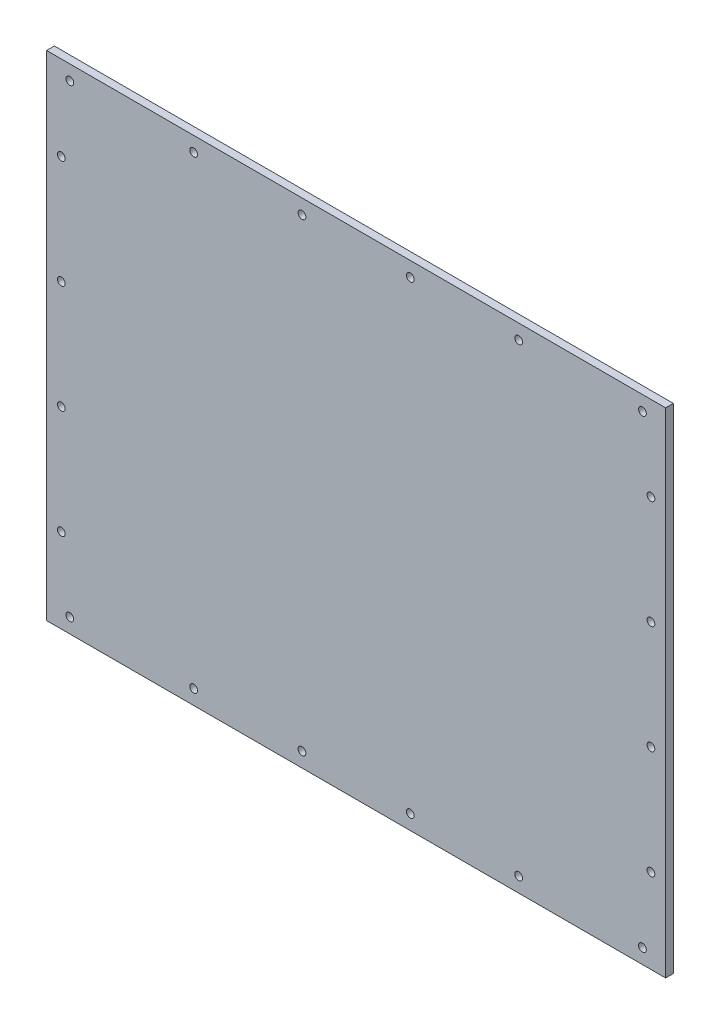
ISO-10303-21;
HEADER;
FILE_DESCRIPTION(('STEP AP214'),'2;1');
FILE_NAME('part.step','',(''),(''),'','','');
FILE_SCHEMA(('AUTOMOTIVE_DESIGN { 1 0 10303 214 1 1 1 1 }'));
ENDSEC;
DATA;
#1=APPLICATION_CONTEXT('core data for automotive mechanical design processes');
#2=APPLICATION_PROTOCOL_DEFINITION('international standard','automotive_design',2000,#1);
#3=PRODUCT_CONTEXT('',#1,'mechanical');
#4=PRODUCT('Part','Part','',(#3));
#5=PRODUCT_RELATED_PRODUCT_CATEGORY('part','',(#4));
#6=PRODUCT_DEFINITION_FORMATION('','',#4);
#7=PRODUCT_DEFINITION_CONTEXT('part definition',#1,'design');
#8=PRODUCT_DEFINITION('design','',#6,#7);
#9=PRODUCT_DEFINITION_SHAPE('','',#8);
#10=(LENGTH_UNIT() NAMED_UNIT(*) SI_UNIT(.MILLI.,.METRE.));
#11=(NAMED_UNIT(*) PLANE_ANGLE_UNIT() SI_UNIT($,.RADIAN.));
#12=(NAMED_UNIT(*) SI_UNIT($,.STERADIAN.) SOLID_ANGLE_UNIT());
#13=UNCERTAINTY_MEASURE_WITH_UNIT(LENGTH_MEASURE(1.E-05),#10,'distance_accuracy_value','');
#14=(GEOMETRIC_REPRESENTATION_CONTEXT(3) GLOBAL_UNCERTAINTY_ASSIGNED_CONTEXT((#13)) GLOBAL_UNIT_ASSIGNED_CONTEXT((#10,
#11,#12)) REPRESENTATION_CONTEXT('',''));
#15=CARTESIAN_POINT('',(0.,0.,0.));
#16=DIRECTION('',(0.,0.,1.));
#17=DIRECTION('',(1.,0.,0.));
#18=AXIS2_PLACEMENT_3D('',#15,#16,#17);
#19=CARTESIAN_POINT('',(0.,0.,5.));
#20=DIRECTION('',(1.,0.,0.));
#21=DIRECTION('',(0.,1.,0.));
#22=AXIS2_PLACEMENT_3D('',#19,#20,#21);
#23=PLANE('',#22);
#24=DIRECTION('',(0.,-1.,0.));
#25=VECTOR('',#24,1.);
#26=CARTESIAN_POINT('',(0.,0.,0.));
#27=LINE('',#26,#25);
#28=CARTESIAN_POINT('',(-1.11022302462516E-13,319.05,0.));
#29=VERTEX_POINT('',#28);
#30=CARTESIAN_POINT('',(0.,0.,0.));
#31=VERTEX_POINT('',#30);
#32=EDGE_CURVE('E113',#29,#31,#27,.T.);
#33=ORIENTED_EDGE('',*,*,#32,.T.);
#34=DIRECTION('',(0.,0.,-1.));
#35=VECTOR('',#34,1.);
#36=CARTESIAN_POINT('',(0.,0.,5.));
#37=LINE('',#36,#35);
#38=CARTESIAN_POINT('',(0.,0.,5.));
#39=VERTEX_POINT('',#38);
#40=EDGE_CURVE('E11',#39,#31,#37,.T.);
#41=ORIENTED_EDGE('',*,*,#40,.F.);
#42=DIRECTION('',(0.,-1.,0.));
#43=VECTOR('',#42,1.);
#44=CARTESIAN_POINT('',(0.,0.,5.));
#45=LINE('',#44,#43);
#46=CARTESIAN_POINT('',(-1.11022302462516E-13,319.05,5.));
#47=VERTEX_POINT('',#46);
#48=EDGE_CURVE('E96',#47,#39,#45,.T.);
#49=ORIENTED_EDGE('',*,*,#48,.F.);
#50=DIRECTION('',(0.,0.,-1.));
#51=VECTOR('',#50,1.);
#52=CARTESIAN_POINT('',(-1.11022302462516E-13,319.05,5.));
#53=LINE('',#52,#51);
#54=EDGE_CURVE('E109',#47,#29,#53,.T.);
#55=ORIENTED_EDGE('',*,*,#54,.T.);
#56=EDGE_LOOP('',(#33,#41,#49,#55));
#57=FACE_BOUND('',#56,.T.);
#58=ADVANCED_FACE('F42',(#57),#23,.F.);
#59=CARTESIAN_POINT('',(0.,0.,5.));
#60=DIRECTION('',(0.,1.,0.));
#61=DIRECTION('',(0.,0.,1.));
#62=AXIS2_PLACEMENT_3D('',#59,#60,#61);
#63=PLANE('',#62);
#64=DIRECTION('',(1.,0.,0.));
#65=VECTOR('',#64,1.);
#66=CARTESIAN_POINT('',(0.,0.,0.));
#67=LINE('',#66,#65);
#68=CARTESIAN_POINT('',(400.,0.,0.));
#69=VERTEX_POINT('',#68);
#70=EDGE_CURVE('E101',#31,#69,#67,.T.);
#71=ORIENTED_EDGE('',*,*,#70,.T.);
#72=DIRECTION('',(0.,0.,-1.));
#73=VECTOR('',#72,1.);
#74=CARTESIAN_POINT('',(400.,0.,5.));
#75=LINE('',#74,#73);
#76=CARTESIAN_POINT('',(400.,0.,5.));
#77=VERTEX_POINT('',#76);
#78=EDGE_CURVE('E52',#77,#69,#75,.T.);
#79=ORIENTED_EDGE('',*,*,#78,.F.);
#80=DIRECTION('',(1.,0.,0.));
#81=VECTOR('',#80,1.);
#82=CARTESIAN_POINT('',(0.,0.,5.));
#83=LINE('',#82,#81);
#84=EDGE_CURVE('E91',#39,#77,#83,.T.);
#85=ORIENTED_EDGE('',*,*,#84,.F.);
#86=ORIENTED_EDGE('',*,*,#40,.T.);
#87=EDGE_LOOP('',(#71,#79,#85,#86));
#88=FACE_BOUND('',#87,.T.);
#89=ADVANCED_FACE('F100',(#88),#63,.F.);
#90=CARTESIAN_POINT('',(400.,0.,5.));
#91=DIRECTION('',(-1.,0.,0.));
#92=DIRECTION('',(0.,-1.,0.));
#93=AXIS2_PLACEMENT_3D('',#90,#91,#92);
#94=PLANE('',#93);
#95=DIRECTION('',(0.,1.,0.));
#96=VECTOR('',#95,1.);
#97=CARTESIAN_POINT('',(400.,0.,0.));
#98=LINE('',#97,#96);
#99=CARTESIAN_POINT('',(400.,319.05,0.));
#100=VERTEX_POINT('',#99);
#101=EDGE_CURVE('E78',#69,#100,#98,.T.);
#102=ORIENTED_EDGE('',*,*,#101,.T.);
#103=DIRECTION('',(0.,0.,-1.));
#104=VECTOR('',#103,1.);
#105=CARTESIAN_POINT('',(400.,319.05,5.));
#106=LINE('',#105,#104);
#107=CARTESIAN_POINT('',(400.,319.05,5.));
#108=VERTEX_POINT('',#107);
#109=EDGE_CURVE('E103',#108,#100,#106,.T.);
#110=ORIENTED_EDGE('',*,*,#109,.F.);
#111=DIRECTION('',(0.,1.,0.));
#112=VECTOR('',#111,1.);
#113=CARTESIAN_POINT('',(400.,0.,5.));
#114=LINE('',#113,#112);
#115=EDGE_CURVE('E94',#77,#108,#114,.T.);
#116=ORIENTED_EDGE('',*,*,#115,.F.);
#117=ORIENTED_EDGE('',*,*,#78,.T.);
#118=EDGE_LOOP('',(#102,#110,#116,#117));
#119=FACE_BOUND('',#118,.T.);
#120=ADVANCED_FACE('F105',(#119),#94,.F.);
#121=CARTESIAN_POINT('',(-1.11022302462516E-13,319.05,5.));
#122=DIRECTION('',(0.,-1.,0.));
#123=DIRECTION('',(0.,0.,-1.));
#124=AXIS2_PLACEMENT_3D('',#121,#122,#123);
#125=PLANE('',#124);
#126=DIRECTION('',(-1.,0.,0.));
#127=VECTOR('',#126,1.);
#128=CARTESIAN_POINT('',(-1.11022302462516E-13,319.05,0.));
#129=LINE('',#128,#127);
#130=EDGE_CURVE('E84',#100,#29,#129,.T.);
#131=ORIENTED_EDGE('',*,*,#130,.T.);
#132=ORIENTED_EDGE('',*,*,#54,.F.);
#133=DIRECTION('',(-1.,0.,0.));
#134=VECTOR('',#133,1.);
#135=CARTESIAN_POINT('',(-1.11022302462516E-13,319.05,5.));
#136=LINE('',#135,#134);
#137=EDGE_CURVE('E61',#108,#47,#136,.T.);
#138=ORIENTED_EDGE('',*,*,#137,.F.);
#139=ORIENTED_EDGE('',*,*,#109,.T.);
#140=EDGE_LOOP('',(#131,#132,#138,#139));
#141=FACE_BOUND('',#140,.T.);
#142=ADVANCED_FACE('F208',(#141),#125,.F.);
#143=CARTESIAN_POINT('',(0.,0.,5.));
#144=DIRECTION('',(0.,0.,-1.));
#145=DIRECTION('',(-1.,0.,0.));
#146=AXIS2_PLACEMENT_3D('',#143,#144,#145);
#147=PLANE('',#146);
#148=CARTESIAN_POINT('',(9.49999999999989,194.525,5.));
#149=DIRECTION('',(0.,0.,1.));
#150=DIRECTION('',(1.,0.,0.));
#151=AXIS2_PLACEMENT_3D('',#148,#149,#150);
#152=CIRCLE('',#151,2.5);
#153=CARTESIAN_POINT('',(11.9999999999999,194.525,5.));
#154=VERTEX_POINT('',#153);
#155=EDGE_CURVE('E508',#154,#154,#152,.T.);
#156=ORIENTED_EDGE('',*,*,#155,.F.);
#157=EDGE_LOOP('',(#156));
#158=FACE_BOUND('',#157,.T.);
#159=CARTESIAN_POINT('',(9.49999999999989,124.525,5.));
#160=DIRECTION('',(0.,0.,1.));
#161=DIRECTION('',(-1.,0.,0.));
#162=AXIS2_PLACEMENT_3D('',#159,#160,#161);
#163=CIRCLE('',#162,2.5);
#164=CARTESIAN_POINT('',(6.99999999999989,124.525,5.));
#165=VERTEX_POINT('',#164);
#166=EDGE_CURVE('E517',#165,#165,#163,.T.);
#167=ORIENTED_EDGE('',*,*,#166,.F.);
#168=EDGE_LOOP('',(#167));
#169=FACE_BOUND('',#168,.T.);
#170=CARTESIAN_POINT('',(9.49999999999989,54.525,5.));
#171=DIRECTION('',(0.,0.,1.));
#172=DIRECTION('',(-1.,0.,0.));
#173=AXIS2_PLACEMENT_3D('',#170,#171,#172);
#174=CIRCLE('',#173,2.5);
#175=CARTESIAN_POINT('',(6.99999999999989,54.525,5.));
#176=VERTEX_POINT('',#175);
#177=EDGE_CURVE('E530',#176,#176,#174,.T.);
#178=ORIENTED_EDGE('',*,*,#177,.F.);
#179=EDGE_LOOP('',(#178));
#180=FACE_BOUND('',#179,.T.);
#181=CARTESIAN_POINT('',(390.5,54.525,5.));
#182=DIRECTION('',(0.,0.,1.));
#183=DIRECTION('',(1.,0.,0.));
#184=AXIS2_PLACEMENT_3D('',#181,#182,#183);
#185=CIRCLE('',#184,2.50000000000002);
#186=CARTESIAN_POINT('',(393.,54.525,5.));
#187=VERTEX_POINT('',#186);
#188=EDGE_CURVE('E538',#187,#187,#185,.T.);
#189=ORIENTED_EDGE('',*,*,#188,.F.);
#190=EDGE_LOOP('',(#189));
#191=FACE_BOUND('',#190,.T.);
#192=CARTESIAN_POINT('',(390.5,124.525,5.));
#193=DIRECTION('',(0.,0.,1.));
#194=DIRECTION('',(1.,0.,0.));
#195=AXIS2_PLACEMENT_3D('',#192,#193,#194);
#196=CIRCLE('',#195,2.50000000000002);
#197=CARTESIAN_POINT('',(393.,124.525,5.));
#198=VERTEX_POINT('',#197);
#199=EDGE_CURVE('E546',#198,#198,#196,.T.);
#200=ORIENTED_EDGE('',*,*,#199,.F.);
#201=EDGE_LOOP('',(#200));
#202=FACE_BOUND('',#201,.T.);
#203=CARTESIAN_POINT('',(390.5,194.525,5.));
#204=DIRECTION('',(0.,0.,1.));
#205=DIRECTION('',(-1.,0.,0.));
#206=AXIS2_PLACEMENT_3D('',#203,#204,#205);
#207=CIRCLE('',#206,2.50000000000002);
#208=CARTESIAN_POINT('',(388.,194.525,5.));
#209=VERTEX_POINT('',#208);
#210=EDGE_CURVE('E647',#209,#209,#207,.T.);
#211=ORIENTED_EDGE('',*,*,#210,.F.);
#212=EDGE_LOOP('',(#211));
#213=FACE_BOUND('',#212,.T.);
#214=CARTESIAN_POINT('',(390.5,264.525,5.));
#215=DIRECTION('',(0.,0.,1.));
#216=DIRECTION('',(-1.,0.,0.));
#217=AXIS2_PLACEMENT_3D('',#214,#215,#216);
#218=CIRCLE('',#217,2.50000000000002);
#219=CARTESIAN_POINT('',(388.,264.525,5.));
#220=VERTEX_POINT('',#219);
#221=EDGE_CURVE('E656',#220,#220,#218,.T.);
#222=ORIENTED_EDGE('',*,*,#221,.F.);
#223=EDGE_LOOP('',(#222));
#224=FACE_BOUND('',#223,.T.);
#225=CARTESIAN_POINT('',(9.49999999999989,264.525,5.));
#226=DIRECTION('',(0.,0.,1.));
#227=DIRECTION('',(1.,0.,0.));
#228=AXIS2_PLACEMENT_3D('',#225,#226,#227);
#229=CIRCLE('',#228,2.5);
#230=CARTESIAN_POINT('',(11.9999999999999,264.525,5.));
#231=VERTEX_POINT('',#230);
#232=EDGE_CURVE('E510',#231,#231,#229,.T.);
#233=ORIENTED_EDGE('',*,*,#232,.F.);
#234=EDGE_LOOP('',(#233));
#235=FACE_BOUND('',#234,.T.);
#236=CARTESIAN_POINT('',(235.,309.55,5.));
#237=DIRECTION('',(0.,0.,1.));
#238=DIRECTION('',(1.,0.,0.));
#239=AXIS2_PLACEMENT_3D('',#236,#237,#238);
#240=CIRCLE('',#239,2.5);
#241=CARTESIAN_POINT('',(237.5,309.55,5.));
#242=VERTEX_POINT('',#241);
#243=EDGE_CURVE('E555',#242,#242,#240,.T.);
#244=ORIENTED_EDGE('',*,*,#243,.F.);
#245=EDGE_LOOP('',(#244));
#246=FACE_BOUND('',#245,.T.);
#247=CARTESIAN_POINT('',(305.,309.55,5.));
#248=DIRECTION('',(0.,0.,1.));
#249=DIRECTION('',(1.,0.,0.));
#250=AXIS2_PLACEMENT_3D('',#247,#248,#249);
#251=CIRCLE('',#250,2.50000000000002);
#252=CARTESIAN_POINT('',(307.5,309.55,5.));
#253=VERTEX_POINT('',#252);
#254=EDGE_CURVE('E572',#253,#253,#251,.T.);
#255=ORIENTED_EDGE('',*,*,#254,.F.);
#256=EDGE_LOOP('',(#255));
#257=FACE_BOUND('',#256,.T.);
#258=CARTESIAN_POINT('',(385.,309.55,5.));
#259=DIRECTION('',(0.,0.,1.));
#260=DIRECTION('',(1.,0.,0.));
#261=AXIS2_PLACEMENT_3D('',#258,#259,#260);
#262=CIRCLE('',#261,2.49999999999997);
#263=CARTESIAN_POINT('',(387.5,309.55,5.));
#264=VERTEX_POINT('',#263);
#265=EDGE_CURVE('E568',#264,#264,#262,.T.);
#266=ORIENTED_EDGE('',*,*,#265,.F.);
#267=EDGE_LOOP('',(#266));
#268=FACE_BOUND('',#267,.T.);
#269=CARTESIAN_POINT('',(385.,9.5,5.));
#270=DIRECTION('',(0.,0.,1.));
#271=DIRECTION('',(-1.,0.,0.));
#272=AXIS2_PLACEMENT_3D('',#269,#270,#271);
#273=CIRCLE('',#272,2.49999999999996);
#274=CARTESIAN_POINT('',(382.5,9.5,5.));
#275=VERTEX_POINT('',#274);
#276=EDGE_CURVE('E563',#275,#275,#273,.T.);
#277=ORIENTED_EDGE('',*,*,#276,.F.);
#278=EDGE_LOOP('',(#277));
#279=FACE_BOUND('',#278,.T.);
#280=CARTESIAN_POINT('',(95.,9.5,5.));
#281=DIRECTION('',(0.,0.,1.));
#282=DIRECTION('',(1.,0.,0.));
#283=AXIS2_PLACEMENT_3D('',#280,#281,#282);
#284=CIRCLE('',#283,2.49999999999999);
#285=CARTESIAN_POINT('',(97.5,9.5,5.));
#286=VERTEX_POINT('',#285);
#287=EDGE_CURVE('E587',#286,#286,#284,.T.);
#288=ORIENTED_EDGE('',*,*,#287,.F.);
#289=EDGE_LOOP('',(#288));
#290=FACE_BOUND('',#289,.T.);
#291=CARTESIAN_POINT('',(235.,9.49999999999999,5.));
#292=DIRECTION('',(0.,0.,1.));
#293=DIRECTION('',(-1.,0.,0.));
#294=AXIS2_PLACEMENT_3D('',#291,#292,#293);
#295=CIRCLE('',#294,2.5);
#296=CARTESIAN_POINT('',(232.5,9.49999999999999,5.));
#297=VERTEX_POINT('',#296);
#298=EDGE_CURVE('E583',#297,#297,#295,.T.);
#299=ORIENTED_EDGE('',*,*,#298,.F.);
#300=EDGE_LOOP('',(#299));
#301=FACE_BOUND('',#300,.T.);
#302=CARTESIAN_POINT('',(305.,9.49999999999999,5.));
#303=DIRECTION('',(0.,0.,1.));
#304=DIRECTION('',(-1.,0.,0.));
#305=AXIS2_PLACEMENT_3D('',#302,#303,#304);
#306=CIRCLE('',#305,2.50000000000002);
#307=CARTESIAN_POINT('',(302.5,9.49999999999999,5.));
#308=VERTEX_POINT('',#307);
#309=EDGE_CURVE('E579',#308,#308,#306,.T.);
#310=ORIENTED_EDGE('',*,*,#309,.F.);
#311=EDGE_LOOP('',(#310));
#312=FACE_BOUND('',#311,.T.);
#313=CARTESIAN_POINT('',(165.,9.5,5.));
#314=DIRECTION('',(0.,0.,1.));
#315=DIRECTION('',(1.,0.,0.));
#316=AXIS2_PLACEMENT_3D('',#313,#314,#315);
#317=CIRCLE('',#316,2.5);
#318=CARTESIAN_POINT('',(167.5,9.5,5.));
#319=VERTEX_POINT('',#318);
#320=EDGE_CURVE('E567',#319,#319,#317,.T.);
#321=ORIENTED_EDGE('',*,*,#320,.F.);
#322=EDGE_LOOP('',(#321));
#323=FACE_BOUND('',#322,.T.);
#324=CARTESIAN_POINT('',(165.,309.55,5.));
#325=DIRECTION('',(0.,0.,1.));
#326=DIRECTION('',(-1.,0.,0.));
#327=AXIS2_PLACEMENT_3D('',#324,#325,#326);
#328=CIRCLE('',#327,2.5);
#329=CARTESIAN_POINT('',(162.5,309.55,5.));
#330=VERTEX_POINT('',#329);
#331=EDGE_CURVE('E551',#330,#330,#328,.T.);
#332=ORIENTED_EDGE('',*,*,#331,.F.);
#333=EDGE_LOOP('',(#332));
#334=FACE_BOUND('',#333,.T.);
#335=CARTESIAN_POINT('',(95.,309.55,5.));
#336=DIRECTION('',(0.,0.,1.));
#337=DIRECTION('',(-1.,0.,0.));
#338=AXIS2_PLACEMENT_3D('',#335,#336,#337);
#339=CIRCLE('',#338,2.49999999999998);
#340=CARTESIAN_POINT('',(92.5,309.55,5.));
#341=VERTEX_POINT('',#340);
#342=EDGE_CURVE('E556',#341,#341,#339,.T.);
#343=ORIENTED_EDGE('',*,*,#342,.F.);
#344=EDGE_LOOP('',(#343));
#345=FACE_BOUND('',#344,.T.);
#346=CARTESIAN_POINT('',(15.,309.55,5.));
#347=DIRECTION('',(0.,0.,1.));
#348=DIRECTION('',(-1.,0.,0.));
#349=AXIS2_PLACEMENT_3D('',#346,#347,#348);
#350=CIRCLE('',#349,2.5);
#351=CARTESIAN_POINT('',(12.5,309.55,5.));
#352=VERTEX_POINT('',#351);
#353=EDGE_CURVE('E549',#352,#352,#350,.T.);
#354=ORIENTED_EDGE('',*,*,#353,.F.);
#355=EDGE_LOOP('',(#354));
#356=FACE_BOUND('',#355,.T.);
#357=CARTESIAN_POINT('',(15.,9.5,5.));
#358=DIRECTION('',(0.,0.,1.));
#359=DIRECTION('',(1.,0.,0.));
#360=AXIS2_PLACEMENT_3D('',#357,#358,#359);
#361=CIRCLE('',#360,2.5);
#362=CARTESIAN_POINT('',(17.5,9.5,5.));
#363=VERTEX_POINT('',#362);
#364=EDGE_CURVE('E132',#363,#363,#361,.T.);
#365=ORIENTED_EDGE('',*,*,#364,.F.);
#366=EDGE_LOOP('',(#365));
#367=FACE_BOUND('',#366,.T.);
#368=ORIENTED_EDGE('',*,*,#48,.T.);
#369=ORIENTED_EDGE('',*,*,#84,.T.);
#370=ORIENTED_EDGE('',*,*,#115,.T.);
#371=ORIENTED_EDGE('',*,*,#137,.T.);
#372=EDGE_LOOP('',(#368,#369,#370,#371));
#373=FACE_BOUND('',#372,.T.);
#374=ADVANCED_FACE('F92',(#158,#169,#180,#191,#202,#213,#224,#235,#246,#257,#268,#279,#290,#301,
#312,#323,#334,#345,#356,#367,#373),#147,.F.);
#375=CARTESIAN_POINT('',(0.,0.,0.));
#376=DIRECTION('',(0.,0.,-1.));
#377=DIRECTION('',(-1.,0.,0.));
#378=AXIS2_PLACEMENT_3D('',#375,#376,#377);
#379=PLANE('',#378);
#380=CARTESIAN_POINT('',(9.49999999999989,194.525,0.));
#381=DIRECTION('',(0.,0.,1.));
#382=DIRECTION('',(1.,0.,0.));
#383=AXIS2_PLACEMENT_3D('',#380,#381,#382);
#384=CIRCLE('',#383,2.5);
#385=CARTESIAN_POINT('',(11.9999999999999,194.525,0.));
#386=VERTEX_POINT('',#385);
#387=EDGE_CURVE('E505',#386,#386,#384,.T.);
#388=ORIENTED_EDGE('',*,*,#387,.T.);
#389=EDGE_LOOP('',(#388));
#390=FACE_BOUND('',#389,.T.);
#391=CARTESIAN_POINT('',(9.49999999999989,124.525,0.));
#392=DIRECTION('',(0.,0.,1.));
#393=DIRECTION('',(-1.,0.,0.));
#394=AXIS2_PLACEMENT_3D('',#391,#392,#393);
#395=CIRCLE('',#394,2.5);
#396=CARTESIAN_POINT('',(6.99999999999989,124.525,0.));
#397=VERTEX_POINT('',#396);
#398=EDGE_CURVE('E526',#397,#397,#395,.T.);
#399=ORIENTED_EDGE('',*,*,#398,.T.);
#400=EDGE_LOOP('',(#399));
#401=FACE_BOUND('',#400,.T.);
#402=CARTESIAN_POINT('',(9.49999999999989,54.525,0.));
#403=DIRECTION('',(0.,0.,1.));
#404=DIRECTION('',(-1.,0.,0.));
#405=AXIS2_PLACEMENT_3D('',#402,#403,#404);
#406=CIRCLE('',#405,2.5);
#407=CARTESIAN_POINT('',(6.99999999999989,54.525,0.));
#408=VERTEX_POINT('',#407);
#409=EDGE_CURVE('E534',#408,#408,#406,.T.);
#410=ORIENTED_EDGE('',*,*,#409,.T.);
#411=EDGE_LOOP('',(#410));
#412=FACE_BOUND('',#411,.T.);
#413=CARTESIAN_POINT('',(390.5,54.525,0.));
#414=DIRECTION('',(0.,0.,1.));
#415=DIRECTION('',(1.,0.,0.));
#416=AXIS2_PLACEMENT_3D('',#413,#414,#415);
#417=CIRCLE('',#416,2.50000000000002);
#418=CARTESIAN_POINT('',(393.,54.525,0.));
#419=VERTEX_POINT('',#418);
#420=EDGE_CURVE('E542',#419,#419,#417,.T.);
#421=ORIENTED_EDGE('',*,*,#420,.T.);
#422=EDGE_LOOP('',(#421));
#423=FACE_BOUND('',#422,.T.);
#424=CARTESIAN_POINT('',(390.5,124.525,0.));
#425=DIRECTION('',(0.,0.,1.));
#426=DIRECTION('',(1.,0.,0.));
#427=AXIS2_PLACEMENT_3D('',#424,#425,#426);
#428=CIRCLE('',#427,2.50000000000002);
#429=CARTESIAN_POINT('',(393.,124.525,0.));
#430=VERTEX_POINT('',#429);
#431=EDGE_CURVE('E641',#430,#430,#428,.T.);
#432=ORIENTED_EDGE('',*,*,#431,.T.);
#433=EDGE_LOOP('',(#432));
#434=FACE_BOUND('',#433,.T.);
#435=CARTESIAN_POINT('',(390.5,194.525,0.));
#436=DIRECTION('',(0.,0.,1.));
#437=DIRECTION('',(-1.,0.,0.));
#438=AXIS2_PLACEMENT_3D('',#435,#436,#437);
#439=CIRCLE('',#438,2.50000000000002);
#440=CARTESIAN_POINT('',(388.,194.525,0.));
#441=VERTEX_POINT('',#440);
#442=EDGE_CURVE('E653',#441,#441,#439,.T.);
#443=ORIENTED_EDGE('',*,*,#442,.T.);
#444=EDGE_LOOP('',(#443));
#445=FACE_BOUND('',#444,.T.);
#446=CARTESIAN_POINT('',(390.5,264.525,0.));
#447=DIRECTION('',(0.,0.,1.));
#448=DIRECTION('',(-1.,0.,0.));
#449=AXIS2_PLACEMENT_3D('',#446,#447,#448);
#450=CIRCLE('',#449,2.50000000000002);
#451=CARTESIAN_POINT('',(388.,264.525,0.));
#452=VERTEX_POINT('',#451);
#453=EDGE_CURVE('E520',#452,#452,#450,.T.);
#454=ORIENTED_EDGE('',*,*,#453,.T.);
#455=EDGE_LOOP('',(#454));
#456=FACE_BOUND('',#455,.T.);
#457=CARTESIAN_POINT('',(9.49999999999989,264.525,0.));
#458=DIRECTION('',(0.,0.,1.));
#459=DIRECTION('',(1.,0.,0.));
#460=AXIS2_PLACEMENT_3D('',#457,#458,#459);
#461=CIRCLE('',#460,2.5);
#462=CARTESIAN_POINT('',(11.9999999999999,264.525,0.));
#463=VERTEX_POINT('',#462);
#464=EDGE_CURVE('E515',#463,#463,#461,.T.);
#465=ORIENTED_EDGE('',*,*,#464,.T.);
#466=EDGE_LOOP('',(#465));
#467=FACE_BOUND('',#466,.T.);
#468=CARTESIAN_POINT('',(235.,309.55,0.));
#469=DIRECTION('',(0.,0.,-1.));
#470=DIRECTION('',(-1.,0.,0.));
#471=AXIS2_PLACEMENT_3D('',#468,#469,#470);
#472=CIRCLE('',#471,2.5);
#473=CARTESIAN_POINT('',(232.5,309.55,0.));
#474=VERTEX_POINT('',#473);
#475=EDGE_CURVE('E45',#474,#474,#472,.T.);
#476=ORIENTED_EDGE('',*,*,#475,.F.);
#477=EDGE_LOOP('',(#476));
#478=FACE_BOUND('',#477,.T.);
#479=CARTESIAN_POINT('',(305.,309.55,0.));
#480=DIRECTION('',(0.,0.,-1.));
#481=DIRECTION('',(-1.,0.,0.));
#482=AXIS2_PLACEMENT_3D('',#479,#480,#481);
#483=CIRCLE('',#482,2.50000000000002);
#484=CARTESIAN_POINT('',(302.5,309.55,0.));
#485=VERTEX_POINT('',#484);
#486=EDGE_CURVE('E167',#485,#485,#483,.T.);
#487=ORIENTED_EDGE('',*,*,#486,.F.);
#488=EDGE_LOOP('',(#487));
#489=FACE_BOUND('',#488,.T.);
#490=CARTESIAN_POINT('',(385.,309.55,0.));
#491=DIRECTION('',(0.,0.,-1.));
#492=DIRECTION('',(-1.,0.,0.));
#493=AXIS2_PLACEMENT_3D('',#490,#491,#492);
#494=CIRCLE('',#493,2.49999999999997);
#495=CARTESIAN_POINT('',(382.5,309.55,0.));
#496=VERTEX_POINT('',#495);
#497=EDGE_CURVE('E164',#496,#496,#494,.T.);
#498=ORIENTED_EDGE('',*,*,#497,.F.);
#499=EDGE_LOOP('',(#498));
#500=FACE_BOUND('',#499,.T.);
#501=CARTESIAN_POINT('',(385.,9.5,0.));
#502=DIRECTION('',(0.,0.,-1.));
#503=DIRECTION('',(-1.,0.,0.));
#504=AXIS2_PLACEMENT_3D('',#501,#502,#503);
#505=CIRCLE('',#504,2.49999999999996);
#506=CARTESIAN_POINT('',(382.5,9.5,0.));
#507=VERTEX_POINT('',#506);
#508=EDGE_CURVE('E160',#507,#507,#505,.T.);
#509=ORIENTED_EDGE('',*,*,#508,.F.);
#510=EDGE_LOOP('',(#509));
#511=FACE_BOUND('',#510,.T.);
#512=CARTESIAN_POINT('',(95.,9.5,0.));
#513=DIRECTION('',(0.,0.,-1.));
#514=DIRECTION('',(-1.,0.,0.));
#515=AXIS2_PLACEMENT_3D('',#512,#513,#514);
#516=CIRCLE('',#515,2.49999999999999);
#517=CARTESIAN_POINT('',(92.5,9.5,0.));
#518=VERTEX_POINT('',#517);
#519=EDGE_CURVE('E156',#518,#518,#516,.T.);
#520=ORIENTED_EDGE('',*,*,#519,.F.);
#521=EDGE_LOOP('',(#520));
#522=FACE_BOUND('',#521,.T.);
#523=CARTESIAN_POINT('',(235.,9.49999999999999,0.));
#524=DIRECTION('',(0.,0.,-1.));
#525=DIRECTION('',(-1.,0.,0.));
#526=AXIS2_PLACEMENT_3D('',#523,#524,#525);
#527=CIRCLE('',#526,2.5);
#528=CARTESIAN_POINT('',(232.5,9.49999999999999,0.));
#529=VERTEX_POINT('',#528);
#530=EDGE_CURVE('E152',#529,#529,#527,.T.);
#531=ORIENTED_EDGE('',*,*,#530,.F.);
#532=EDGE_LOOP('',(#531));
#533=FACE_BOUND('',#532,.T.);
#534=CARTESIAN_POINT('',(305.,9.49999999999999,0.));
#535=DIRECTION('',(0.,0.,-1.));
#536=DIRECTION('',(-1.,0.,0.));
#537=AXIS2_PLACEMENT_3D('',#534,#535,#536);
#538=CIRCLE('',#537,2.50000000000002);
#539=CARTESIAN_POINT('',(302.5,9.49999999999999,0.));
#540=VERTEX_POINT('',#539);
#541=EDGE_CURVE('E148',#540,#540,#538,.T.);
#542=ORIENTED_EDGE('',*,*,#541,.F.);
#543=EDGE_LOOP('',(#542));
#544=FACE_BOUND('',#543,.T.);
#545=CARTESIAN_POINT('',(165.,9.5,0.));
#546=DIRECTION('',(0.,0.,-1.));
#547=DIRECTION('',(-1.,0.,0.));
#548=AXIS2_PLACEMENT_3D('',#545,#546,#547);
#549=CIRCLE('',#548,2.5);
#550=CARTESIAN_POINT('',(162.5,9.5,0.));
#551=VERTEX_POINT('',#550);
#552=EDGE_CURVE('E144',#551,#551,#549,.T.);
#553=ORIENTED_EDGE('',*,*,#552,.F.);
#554=EDGE_LOOP('',(#553));
#555=FACE_BOUND('',#554,.T.);
#556=CARTESIAN_POINT('',(165.,309.55,0.));
#557=DIRECTION('',(0.,0.,-1.));
#558=DIRECTION('',(-1.,0.,0.));
#559=AXIS2_PLACEMENT_3D('',#556,#557,#558);
#560=CIRCLE('',#559,2.5);
#561=CARTESIAN_POINT('',(162.5,309.55,0.));
#562=VERTEX_POINT('',#561);
#563=EDGE_CURVE('E140',#562,#562,#560,.T.);
#564=ORIENTED_EDGE('',*,*,#563,.F.);
#565=EDGE_LOOP('',(#564));
#566=FACE_BOUND('',#565,.T.);
#567=CARTESIAN_POINT('',(95.,309.55,0.));
#568=DIRECTION('',(0.,0.,-1.));
#569=DIRECTION('',(-1.,0.,0.));
#570=AXIS2_PLACEMENT_3D('',#567,#568,#569);
#571=CIRCLE('',#570,2.49999999999998);
#572=CARTESIAN_POINT('',(92.5,309.55,0.));
#573=VERTEX_POINT('',#572);
#574=EDGE_CURVE('E136',#573,#573,#571,.T.);
#575=ORIENTED_EDGE('',*,*,#574,.F.);
#576=EDGE_LOOP('',(#575));
#577=FACE_BOUND('',#576,.T.);
#578=CARTESIAN_POINT('',(15.,309.55,0.));
#579=DIRECTION('',(0.,0.,-1.));
#580=DIRECTION('',(-1.,0.,0.));
#581=AXIS2_PLACEMENT_3D('',#578,#579,#580);
#582=CIRCLE('',#581,2.5);
#583=CARTESIAN_POINT('',(12.5,309.55,0.));
#584=VERTEX_POINT('',#583);
#585=EDGE_CURVE('E131',#584,#584,#582,.T.);
#586=ORIENTED_EDGE('',*,*,#585,.F.);
#587=EDGE_LOOP('',(#586));
#588=FACE_BOUND('',#587,.T.);
#589=CARTESIAN_POINT('',(15.,9.5,0.));
#590=DIRECTION('',(0.,0.,-1.));
#591=DIRECTION('',(-1.,0.,0.));
#592=AXIS2_PLACEMENT_3D('',#589,#590,#591);
#593=CIRCLE('',#592,2.5);
#594=CARTESIAN_POINT('',(12.5,9.5,0.));
#595=VERTEX_POINT('',#594);
#596=EDGE_CURVE('E127',#595,#595,#593,.T.);
#597=ORIENTED_EDGE('',*,*,#596,.F.);
#598=EDGE_LOOP('',(#597));
#599=FACE_BOUND('',#598,.T.);
#600=ORIENTED_EDGE('',*,*,#32,.F.);
#601=ORIENTED_EDGE('',*,*,#130,.F.);
#602=ORIENTED_EDGE('',*,*,#101,.F.);
#603=ORIENTED_EDGE('',*,*,#70,.F.);
#604=EDGE_LOOP('',(#600,#601,#602,#603));
#605=FACE_BOUND('',#604,.T.);
#606=ADVANCED_FACE('F179',(#390,#401,#412,#423,#434,#445,#456,#467,#478,#489,#500,#511,#522,
#533,#544,#555,#566,#577,#588,#599,#605),#379,.T.);
#607=CARTESIAN_POINT('',(15.,9.5,-5.));
#608=DIRECTION('',(0.,0.,1.));
#609=DIRECTION('',(1.,0.,0.));
#610=AXIS2_PLACEMENT_3D('',#607,#608,#609);
#611=CYLINDRICAL_SURFACE('',#610,2.5);
#612=ORIENTED_EDGE('',*,*,#596,.T.);
#613=EDGE_LOOP('',(#612));
#614=FACE_BOUND('',#613,.T.);
#615=ORIENTED_EDGE('',*,*,#364,.T.);
#616=EDGE_LOOP('',(#615));
#617=FACE_BOUND('',#616,.T.);
#618=ADVANCED_FACE('F182',(#614,#617),#611,.F.);
#619=CARTESIAN_POINT('',(15.,309.55,-5.));
#620=DIRECTION('',(0.,0.,1.));
#621=DIRECTION('',(1.,0.,0.));
#622=AXIS2_PLACEMENT_3D('',#619,#620,#621);
#623=CYLINDRICAL_SURFACE('',#622,2.5);
#624=ORIENTED_EDGE('',*,*,#585,.T.);
#625=EDGE_LOOP('',(#624));
#626=FACE_BOUND('',#625,.T.);
#627=ORIENTED_EDGE('',*,*,#353,.T.);
#628=EDGE_LOOP('',(#627));
#629=FACE_BOUND('',#628,.T.);
#630=ADVANCED_FACE('F244',(#626,#629),#623,.F.);
#631=CARTESIAN_POINT('',(95.,309.55,-5.));
#632=DIRECTION('',(0.,0.,1.));
#633=DIRECTION('',(1.,0.,0.));
#634=AXIS2_PLACEMENT_3D('',#631,#632,#633);
#635=CYLINDRICAL_SURFACE('',#634,2.49999999999998);
#636=ORIENTED_EDGE('',*,*,#574,.T.);
#637=EDGE_LOOP('',(#636));
#638=FACE_BOUND('',#637,.T.);
#639=ORIENTED_EDGE('',*,*,#342,.T.);
#640=EDGE_LOOP('',(#639));
#641=FACE_BOUND('',#640,.T.);
#642=ADVANCED_FACE('F256',(#638,#641),#635,.F.);
#643=CARTESIAN_POINT('',(165.,309.55,-5.));
#644=DIRECTION('',(0.,0.,1.));
#645=DIRECTION('',(1.,0.,0.));
#646=AXIS2_PLACEMENT_3D('',#643,#644,#645);
#647=CYLINDRICAL_SURFACE('',#646,2.5);
#648=ORIENTED_EDGE('',*,*,#563,.T.);
#649=EDGE_LOOP('',(#648));
#650=FACE_BOUND('',#649,.T.);
#651=ORIENTED_EDGE('',*,*,#331,.T.);
#652=EDGE_LOOP('',(#651));
#653=FACE_BOUND('',#652,.T.);
#654=ADVANCED_FACE('F267',(#650,#653),#647,.F.);
#655=CARTESIAN_POINT('',(165.,9.5,-5.));
#656=DIRECTION('',(0.,0.,1.));
#657=DIRECTION('',(1.,0.,0.));
#658=AXIS2_PLACEMENT_3D('',#655,#656,#657);
#659=CYLINDRICAL_SURFACE('',#658,2.5);
#660=ORIENTED_EDGE('',*,*,#552,.T.);
#661=EDGE_LOOP('',(#660));
#662=FACE_BOUND('',#661,.T.);
#663=ORIENTED_EDGE('',*,*,#320,.T.);
#664=EDGE_LOOP('',(#663));
#665=FACE_BOUND('',#664,.T.);
#666=ADVANCED_FACE('F278',(#662,#665),#659,.F.);
#667=CARTESIAN_POINT('',(305.,9.49999999999999,-5.));
#668=DIRECTION('',(0.,0.,1.));
#669=DIRECTION('',(1.,0.,0.));
#670=AXIS2_PLACEMENT_3D('',#667,#668,#669);
#671=CYLINDRICAL_SURFACE('',#670,2.50000000000002);
#672=ORIENTED_EDGE('',*,*,#541,.T.);
#673=EDGE_LOOP('',(#672));
#674=FACE_BOUND('',#673,.T.);
#675=ORIENTED_EDGE('',*,*,#309,.T.);
#676=EDGE_LOOP('',(#675));
#677=FACE_BOUND('',#676,.T.);
#678=ADVANCED_FACE('F289',(#674,#677),#671,.F.);
#679=CARTESIAN_POINT('',(235.,9.49999999999999,-5.));
#680=DIRECTION('',(0.,0.,1.));
#681=DIRECTION('',(1.,0.,0.));
#682=AXIS2_PLACEMENT_3D('',#679,#680,#681);
#683=CYLINDRICAL_SURFACE('',#682,2.5);
#684=ORIENTED_EDGE('',*,*,#530,.T.);
#685=EDGE_LOOP('',(#684));
#686=FACE_BOUND('',#685,.T.);
#687=ORIENTED_EDGE('',*,*,#298,.T.);
#688=EDGE_LOOP('',(#687));
#689=FACE_BOUND('',#688,.T.);
#690=ADVANCED_FACE('F300',(#686,#689),#683,.F.);
#691=CARTESIAN_POINT('',(95.,9.5,-5.));
#692=DIRECTION('',(0.,0.,1.));
#693=DIRECTION('',(1.,0.,0.));
#694=AXIS2_PLACEMENT_3D('',#691,#692,#693);
#695=CYLINDRICAL_SURFACE('',#694,2.49999999999999);
#696=ORIENTED_EDGE('',*,*,#519,.T.);
#697=EDGE_LOOP('',(#696));
#698=FACE_BOUND('',#697,.T.);
#699=ORIENTED_EDGE('',*,*,#287,.T.);
#700=EDGE_LOOP('',(#699));
#701=FACE_BOUND('',#700,.T.);
#702=ADVANCED_FACE('F311',(#698,#701),#695,.F.);
#703=CARTESIAN_POINT('',(385.,9.5,-5.));
#704=DIRECTION('',(0.,0.,1.));
#705=DIRECTION('',(1.,0.,0.));
#706=AXIS2_PLACEMENT_3D('',#703,#704,#705);
#707=CYLINDRICAL_SURFACE('',#706,2.49999999999996);
#708=ORIENTED_EDGE('',*,*,#508,.T.);
#709=EDGE_LOOP('',(#708));
#710=FACE_BOUND('',#709,.T.);
#711=ORIENTED_EDGE('',*,*,#276,.T.);
#712=EDGE_LOOP('',(#711));
#713=FACE_BOUND('',#712,.T.);
#714=ADVANCED_FACE('F322',(#710,#713),#707,.F.);
#715=CARTESIAN_POINT('',(385.,309.55,-5.));
#716=DIRECTION('',(0.,0.,1.));
#717=DIRECTION('',(1.,0.,0.));
#718=AXIS2_PLACEMENT_3D('',#715,#716,#717);
#719=CYLINDRICAL_SURFACE('',#718,2.49999999999997);
#720=ORIENTED_EDGE('',*,*,#497,.T.);
#721=EDGE_LOOP('',(#720));
#722=FACE_BOUND('',#721,.T.);
#723=ORIENTED_EDGE('',*,*,#265,.T.);
#724=EDGE_LOOP('',(#723));
#725=FACE_BOUND('',#724,.T.);
#726=ADVANCED_FACE('F333',(#722,#725),#719,.F.);
#727=CARTESIAN_POINT('',(305.,309.55,-5.));
#728=DIRECTION('',(0.,0.,1.));
#729=DIRECTION('',(1.,0.,0.));
#730=AXIS2_PLACEMENT_3D('',#727,#728,#729);
#731=CYLINDRICAL_SURFACE('',#730,2.50000000000002);
#732=ORIENTED_EDGE('',*,*,#486,.T.);
#733=EDGE_LOOP('',(#732));
#734=FACE_BOUND('',#733,.T.);
#735=ORIENTED_EDGE('',*,*,#254,.T.);
#736=EDGE_LOOP('',(#735));
#737=FACE_BOUND('',#736,.T.);
#738=ADVANCED_FACE('F344',(#734,#737),#731,.F.);
#739=CARTESIAN_POINT('',(235.,309.55,-5.));
#740=DIRECTION('',(0.,0.,1.));
#741=DIRECTION('',(1.,0.,0.));
#742=AXIS2_PLACEMENT_3D('',#739,#740,#741);
#743=CYLINDRICAL_SURFACE('',#742,2.5);
#744=ORIENTED_EDGE('',*,*,#475,.T.);
#745=EDGE_LOOP('',(#744));
#746=FACE_BOUND('',#745,.T.);
#747=ORIENTED_EDGE('',*,*,#243,.T.);
#748=EDGE_LOOP('',(#747));
#749=FACE_BOUND('',#748,.T.);
#750=ADVANCED_FACE('F176',(#746,#749),#743,.F.);
#751=CARTESIAN_POINT('',(9.49999999999989,264.525,0.));
#752=DIRECTION('',(0.,0.,1.));
#753=DIRECTION('',(1.,0.,0.));
#754=AXIS2_PLACEMENT_3D('',#751,#752,#753);
#755=CYLINDRICAL_SURFACE('',#754,2.5);
#756=ORIENTED_EDGE('',*,*,#464,.F.);
#757=EDGE_LOOP('',(#756));
#758=FACE_BOUND('',#757,.T.);
#759=ORIENTED_EDGE('',*,*,#232,.T.);
#760=EDGE_LOOP('',(#759));
#761=FACE_BOUND('',#760,.T.);
#762=ADVANCED_FACE('F364',(#758,#761),#755,.F.);
#763=CARTESIAN_POINT('',(390.5,264.525,0.));
#764=DIRECTION('',(0.,0.,1.));
#765=DIRECTION('',(1.,0.,0.));
#766=AXIS2_PLACEMENT_3D('',#763,#764,#765);
#767=CYLINDRICAL_SURFACE('',#766,2.50000000000002);
#768=ORIENTED_EDGE('',*,*,#453,.F.);
#769=EDGE_LOOP('',(#768));
#770=FACE_BOUND('',#769,.T.);
#771=ORIENTED_EDGE('',*,*,#221,.T.);
#772=EDGE_LOOP('',(#771));
#773=FACE_BOUND('',#772,.T.);
#774=ADVANCED_FACE('F386',(#770,#773),#767,.F.);
#775=CARTESIAN_POINT('',(390.5,194.525,0.));
#776=DIRECTION('',(0.,0.,1.));
#777=DIRECTION('',(1.,0.,0.));
#778=AXIS2_PLACEMENT_3D('',#775,#776,#777);
#779=CYLINDRICAL_SURFACE('',#778,2.50000000000002);
#780=ORIENTED_EDGE('',*,*,#442,.F.);
#781=EDGE_LOOP('',(#780));
#782=FACE_BOUND('',#781,.T.);
#783=ORIENTED_EDGE('',*,*,#210,.T.);
#784=EDGE_LOOP('',(#783));
#785=FACE_BOUND('',#784,.T.);
#786=ADVANCED_FACE('F397',(#782,#785),#779,.F.);
#787=CARTESIAN_POINT('',(390.5,124.525,0.));
#788=DIRECTION('',(0.,0.,1.));
#789=DIRECTION('',(1.,0.,0.));
#790=AXIS2_PLACEMENT_3D('',#787,#788,#789);
#791=CYLINDRICAL_SURFACE('',#790,2.50000000000002);
#792=ORIENTED_EDGE('',*,*,#431,.F.);
#793=EDGE_LOOP('',(#792));
#794=FACE_BOUND('',#793,.T.);
#795=ORIENTED_EDGE('',*,*,#199,.T.);
#796=EDGE_LOOP('',(#795));
#797=FACE_BOUND('',#796,.T.);
#798=ADVANCED_FACE('F408',(#794,#797),#791,.F.);
#799=CARTESIAN_POINT('',(390.5,54.525,0.));
#800=DIRECTION('',(0.,0.,1.));
#801=DIRECTION('',(1.,0.,0.));
#802=AXIS2_PLACEMENT_3D('',#799,#800,#801);
#803=CYLINDRICAL_SURFACE('',#802,2.50000000000002);
#804=ORIENTED_EDGE('',*,*,#420,.F.);
#805=EDGE_LOOP('',(#804));
#806=FACE_BOUND('',#805,.T.);
#807=ORIENTED_EDGE('',*,*,#188,.T.);
#808=EDGE_LOOP('',(#807));
#809=FACE_BOUND('',#808,.T.);
#810=ADVANCED_FACE('F419',(#806,#809),#803,.F.);
#811=CARTESIAN_POINT('',(9.49999999999989,54.525,0.));
#812=DIRECTION('',(0.,0.,1.));
#813=DIRECTION('',(1.,0.,0.));
#814=AXIS2_PLACEMENT_3D('',#811,#812,#813);
#815=CYLINDRICAL_SURFACE('',#814,2.5);
#816=ORIENTED_EDGE('',*,*,#409,.F.);
#817=EDGE_LOOP('',(#816));
#818=FACE_BOUND('',#817,.T.);
#819=ORIENTED_EDGE('',*,*,#177,.T.);
#820=EDGE_LOOP('',(#819));
#821=FACE_BOUND('',#820,.T.);
#822=ADVANCED_FACE('F430',(#818,#821),#815,.F.);
#823=CARTESIAN_POINT('',(9.49999999999989,124.525,0.));
#824=DIRECTION('',(0.,0.,1.));
#825=DIRECTION('',(1.,0.,0.));
#826=AXIS2_PLACEMENT_3D('',#823,#824,#825);
#827=CYLINDRICAL_SURFACE('',#826,2.5);
#828=ORIENTED_EDGE('',*,*,#398,.F.);
#829=EDGE_LOOP('',(#828));
#830=FACE_BOUND('',#829,.T.);
#831=ORIENTED_EDGE('',*,*,#166,.T.);
#832=EDGE_LOOP('',(#831));
#833=FACE_BOUND('',#832,.T.);
#834=ADVANCED_FACE('F441',(#830,#833),#827,.F.);
#835=CARTESIAN_POINT('',(9.49999999999989,194.525,0.));
#836=DIRECTION('',(0.,0.,1.));
#837=DIRECTION('',(1.,0.,0.));
#838=AXIS2_PLACEMENT_3D('',#835,#836,#837);
#839=CYLINDRICAL_SURFACE('',#838,2.5);
#840=ORIENTED_EDGE('',*,*,#387,.F.);
#841=EDGE_LOOP('',(#840));
#842=FACE_BOUND('',#841,.T.);
#843=ORIENTED_EDGE('',*,*,#155,.T.);
#844=EDGE_LOOP('',(#843));
#845=FACE_BOUND('',#844,.T.);
#846=ADVANCED_FACE('F452',(#842,#845),#839,.F.);
#847=CLOSED_SHELL('',(#58,#89,#120,#142,#374,#606,#618,#630,#642,#654,#666,#678,#690,#702,#714,
#726,#738,#750,#762,#774,#786,#798,#810,#822,#834,#846));
#848=MANIFOLD_SOLID_BREP('B2',#847);
#849=ADVANCED_BREP_SHAPE_REPRESENTATION('',(#18,#848),#14);
#850=SHAPE_DEFINITION_REPRESENTATION(#9,#849);
ENDSEC;
END-ISO-10303-21;
